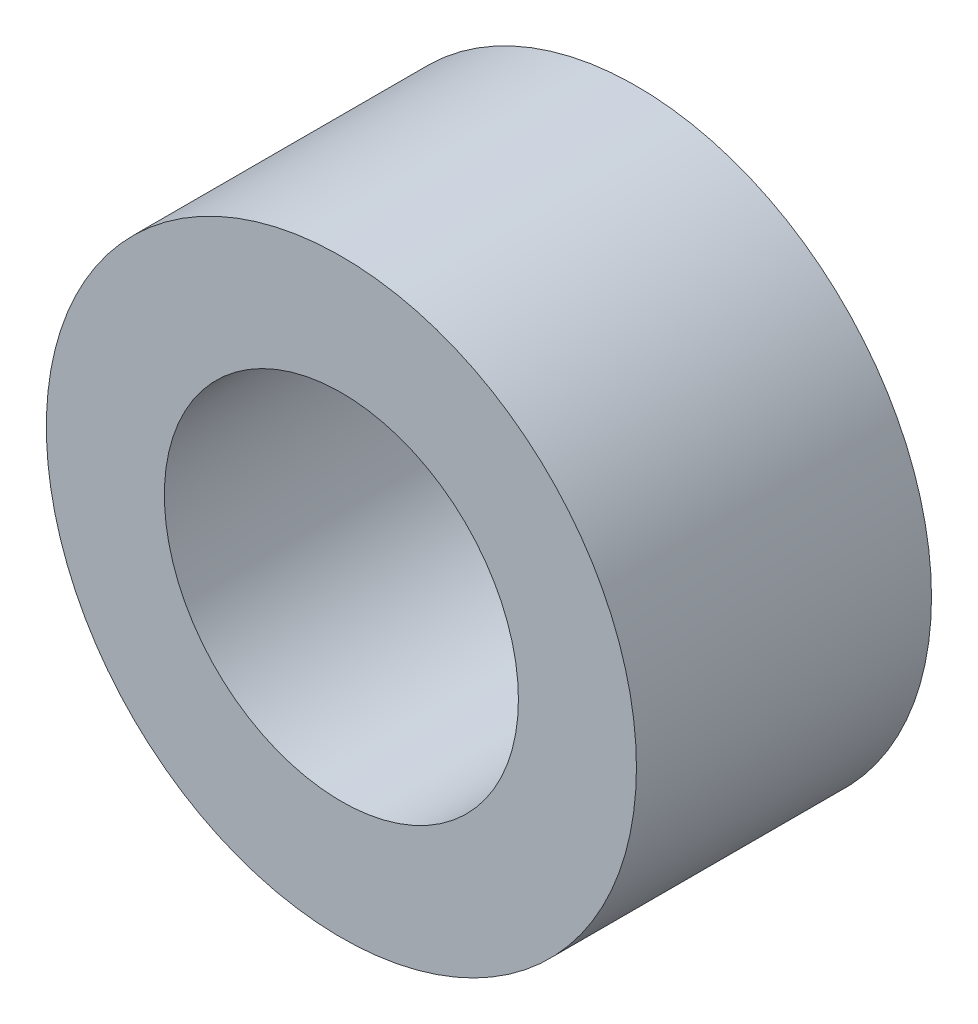
ISO-10303-21;
HEADER;
FILE_DESCRIPTION(('STEP AP214'),'2;1');
FILE_NAME('part.step','',(''),(''),'','','');
FILE_SCHEMA(('AUTOMOTIVE_DESIGN { 1 0 10303 214 1 1 1 1 }'));
ENDSEC;
DATA;
#1=APPLICATION_CONTEXT('core data for automotive mechanical design processes');
#2=APPLICATION_PROTOCOL_DEFINITION('international standard','automotive_design',2000,#1);
#3=PRODUCT_CONTEXT('',#1,'mechanical');
#4=PRODUCT('Part','Part','',(#3));
#5=PRODUCT_RELATED_PRODUCT_CATEGORY('part','',(#4));
#6=PRODUCT_DEFINITION_FORMATION('','',#4);
#7=PRODUCT_DEFINITION_CONTEXT('part definition',#1,'design');
#8=PRODUCT_DEFINITION('design','',#6,#7);
#9=PRODUCT_DEFINITION_SHAPE('','',#8);
#10=(LENGTH_UNIT() NAMED_UNIT(*) SI_UNIT(.MILLI.,.METRE.));
#11=(NAMED_UNIT(*) PLANE_ANGLE_UNIT() SI_UNIT($,.RADIAN.));
#12=(NAMED_UNIT(*) SI_UNIT($,.STERADIAN.) SOLID_ANGLE_UNIT());
#13=UNCERTAINTY_MEASURE_WITH_UNIT(LENGTH_MEASURE(1.E-05),#10,'distance_accuracy_value','');
#14=(GEOMETRIC_REPRESENTATION_CONTEXT(3) GLOBAL_UNCERTAINTY_ASSIGNED_CONTEXT((#13)) GLOBAL_UNIT_ASSIGNED_CONTEXT((#10,
#11,#12)) REPRESENTATION_CONTEXT('',''));
#15=CARTESIAN_POINT('',(0.,0.,0.));
#16=DIRECTION('',(0.,0.,1.));
#17=DIRECTION('',(1.,0.,0.));
#18=AXIS2_PLACEMENT_3D('',#15,#16,#17);
#19=CARTESIAN_POINT('',(0.,0.,5.));
#20=DIRECTION('',(0.,0.,1.));
#21=DIRECTION('',(1.,0.,0.));
#22=AXIS2_PLACEMENT_3D('',#19,#20,#21);
#23=PLANE('',#22);
#24=CARTESIAN_POINT('',(0.,0.,5.));
#25=DIRECTION('',(0.,0.,1.));
#26=DIRECTION('',(1.,0.,0.));
#27=AXIS2_PLACEMENT_3D('',#24,#25,#26);
#28=CIRCLE('',#27,5.);
#29=CARTESIAN_POINT('',(5.,0.,5.));
#30=VERTEX_POINT('',#29);
#31=EDGE_CURVE('E10',#30,#30,#28,.T.);
#32=ORIENTED_EDGE('',*,*,#31,.T.);
#33=EDGE_LOOP('',(#32));
#34=FACE_BOUND('',#33,.T.);
#35=CARTESIAN_POINT('',(0.,0.,5.));
#36=DIRECTION('',(0.,0.,1.));
#37=DIRECTION('',(1.,0.,0.));
#38=AXIS2_PLACEMENT_3D('',#35,#36,#37);
#39=CIRCLE('',#38,3.);
#40=CARTESIAN_POINT('',(3.,0.,5.));
#41=VERTEX_POINT('',#40);
#42=EDGE_CURVE('E54',#41,#41,#39,.T.);
#43=ORIENTED_EDGE('',*,*,#42,.F.);
#44=EDGE_LOOP('',(#43));
#45=FACE_BOUND('',#44,.T.);
#46=ADVANCED_FACE('F41',(#34,#45),#23,.T.);
#47=CARTESIAN_POINT('',(0.,0.,0.));
#48=DIRECTION('',(0.,0.,1.));
#49=DIRECTION('',(1.,0.,0.));
#50=AXIS2_PLACEMENT_3D('',#47,#48,#49);
#51=PLANE('',#50);
#52=CARTESIAN_POINT('',(0.,0.,0.));
#53=DIRECTION('',(0.,0.,1.));
#54=DIRECTION('',(1.,0.,0.));
#55=AXIS2_PLACEMENT_3D('',#52,#53,#54);
#56=CIRCLE('',#55,5.);
#57=CARTESIAN_POINT('',(5.,0.,0.));
#58=VERTEX_POINT('',#57);
#59=EDGE_CURVE('E45',#58,#58,#56,.T.);
#60=ORIENTED_EDGE('',*,*,#59,.F.);
#61=EDGE_LOOP('',(#60));
#62=FACE_BOUND('',#61,.T.);
#63=CARTESIAN_POINT('',(0.,0.,0.));
#64=DIRECTION('',(0.,0.,1.));
#65=DIRECTION('',(1.,0.,0.));
#66=AXIS2_PLACEMENT_3D('',#63,#64,#65);
#67=CIRCLE('',#66,3.);
#68=CARTESIAN_POINT('',(3.,0.,0.));
#69=VERTEX_POINT('',#68);
#70=EDGE_CURVE('E56',#69,#69,#67,.T.);
#71=ORIENTED_EDGE('',*,*,#70,.T.);
#72=EDGE_LOOP('',(#71));
#73=FACE_BOUND('',#72,.T.);
#74=ADVANCED_FACE('F68',(#62,#73),#51,.F.);
#75=CARTESIAN_POINT('',(0.,0.,5.));
#76=DIRECTION('',(0.,0.,-1.));
#77=DIRECTION('',(-1.,0.,0.));
#78=AXIS2_PLACEMENT_3D('',#75,#76,#77);
#79=CYLINDRICAL_SURFACE('',#78,5.);
#80=ORIENTED_EDGE('',*,*,#31,.F.);
#81=EDGE_LOOP('',(#80));
#82=FACE_BOUND('',#81,.T.);
#83=ORIENTED_EDGE('',*,*,#59,.T.);
#84=EDGE_LOOP('',(#83));
#85=FACE_BOUND('',#84,.T.);
#86=ADVANCED_FACE('F43',(#82,#85),#79,.T.);
#87=CARTESIAN_POINT('',(0.,0.,5.));
#88=DIRECTION('',(0.,0.,-1.));
#89=DIRECTION('',(-1.,0.,0.));
#90=AXIS2_PLACEMENT_3D('',#87,#88,#89);
#91=CYLINDRICAL_SURFACE('',#90,3.);
#92=ORIENTED_EDGE('',*,*,#42,.T.);
#93=EDGE_LOOP('',(#92));
#94=FACE_BOUND('',#93,.T.);
#95=ORIENTED_EDGE('',*,*,#70,.F.);
#96=EDGE_LOOP('',(#95));
#97=FACE_BOUND('',#96,.T.);
#98=ADVANCED_FACE('F64',(#94,#97),#91,.F.);
#99=CLOSED_SHELL('',(#46,#74,#86,#98));
#100=MANIFOLD_SOLID_BREP('B2',#99);
#101=ADVANCED_BREP_SHAPE_REPRESENTATION('',(#18,#100),#14);
#102=SHAPE_DEFINITION_REPRESENTATION(#9,#101);
ENDSEC;
END-ISO-10303-21;
